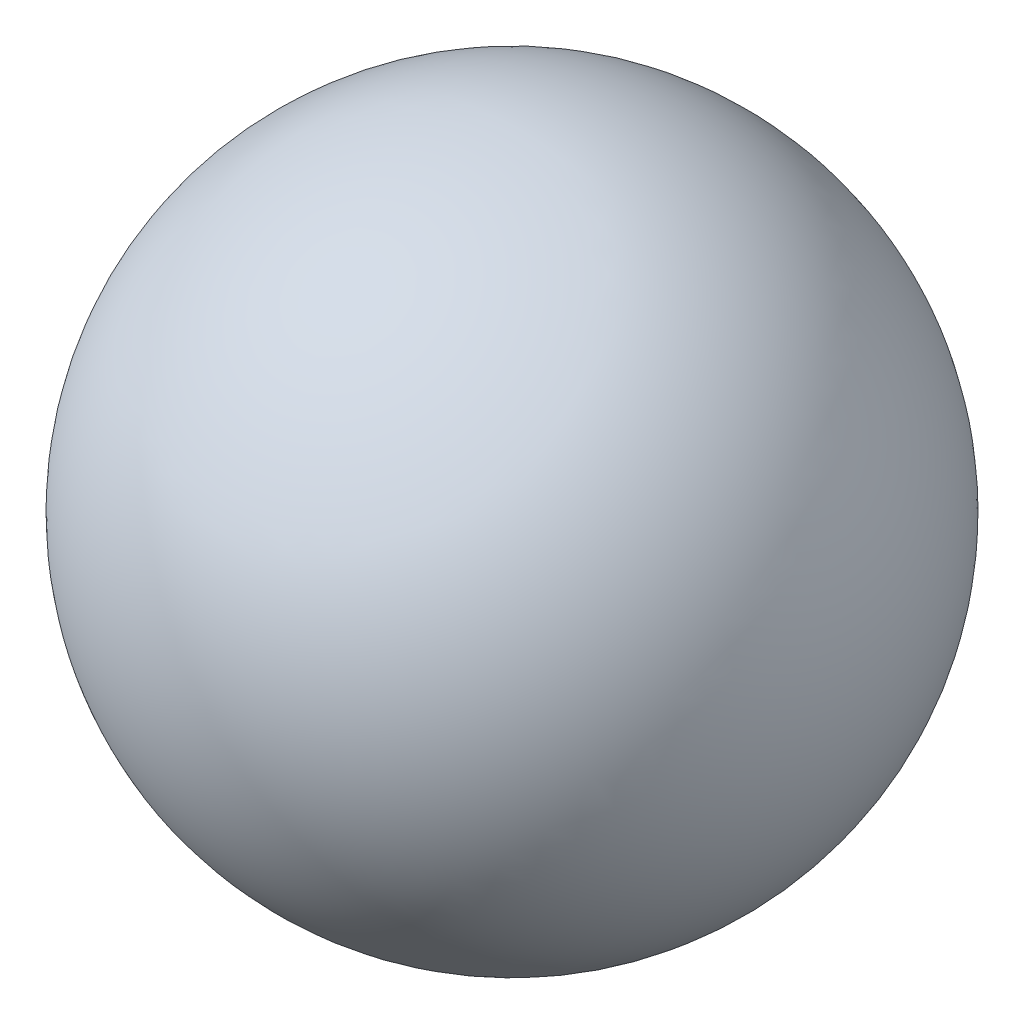
ISO-10303-21;
HEADER;
FILE_DESCRIPTION(('STEP AP214'),'2;1');
FILE_NAME('part.step','',(''),(''),'','','');
FILE_SCHEMA(('AUTOMOTIVE_DESIGN { 1 0 10303 214 1 1 1 1 }'));
ENDSEC;
DATA;
#1=APPLICATION_CONTEXT('core data for automotive mechanical design processes');
#2=APPLICATION_PROTOCOL_DEFINITION('international standard','automotive_design',2000,#1);
#3=PRODUCT_CONTEXT('',#1,'mechanical');
#4=PRODUCT('Part','Part','',(#3));
#5=PRODUCT_RELATED_PRODUCT_CATEGORY('part','',(#4));
#6=PRODUCT_DEFINITION_FORMATION('','',#4);
#7=PRODUCT_DEFINITION_CONTEXT('part definition',#1,'design');
#8=PRODUCT_DEFINITION('design','',#6,#7);
#9=PRODUCT_DEFINITION_SHAPE('','',#8);
#10=(LENGTH_UNIT() NAMED_UNIT(*) SI_UNIT(.MILLI.,.METRE.));
#11=(NAMED_UNIT(*) PLANE_ANGLE_UNIT() SI_UNIT($,.RADIAN.));
#12=(NAMED_UNIT(*) SI_UNIT($,.STERADIAN.) SOLID_ANGLE_UNIT());
#13=UNCERTAINTY_MEASURE_WITH_UNIT(LENGTH_MEASURE(1.E-05),#10,'distance_accuracy_value','');
#14=(GEOMETRIC_REPRESENTATION_CONTEXT(3) GLOBAL_UNCERTAINTY_ASSIGNED_CONTEXT((#13)) GLOBAL_UNIT_ASSIGNED_CONTEXT((#10,
#11,#12)) REPRESENTATION_CONTEXT('',''));
#15=CARTESIAN_POINT('',(0.,0.,0.));
#16=DIRECTION('',(0.,0.,1.));
#17=DIRECTION('',(1.,0.,0.));
#18=AXIS2_PLACEMENT_3D('',#15,#16,#17);
#19=CARTESIAN_POINT('',(0.,4.,0.));
#20=DIRECTION('',(0.,-1.,0.));
#21=DIRECTION('',(-1.,0.,0.));
#22=AXIS2_PLACEMENT_3D('',#19,#20,#21);
#23=SPHERICAL_SURFACE('',#22,4.);
#24=CARTESIAN_POINT('',(0.,4.,0.));
#25=DIRECTION('',(0.,0.,1.));
#26=DIRECTION('',(1.,0.,0.));
#27=AXIS2_PLACEMENT_3D('',#24,#25,#26);
#28=SPHERICAL_SURFACE('',#27,4.);
#29=CARTESIAN_POINT('',(0.,4.,-3.78084302641229));
#30=DIRECTION('',(0.,0.,0.999999999999997));
#31=DIRECTION('',(1.,0.,0.));
#32=AXIS2_PLACEMENT_3D('',#29,#30,#31);
#33=CIRCLE('',#32,1.30584302641229);
#34=CARTESIAN_POINT('',(1.30584302641234,4.,-3.78084302641229));
#35=VERTEX_POINT('',#34);
#36=EDGE_CURVE('E11',#35,#35,#33,.F.);
#37=ORIENTED_EDGE('',*,*,#36,.F.);
#38=EDGE_LOOP('',(#37));
#39=FACE_BOUND('',#38,.T.);
#40=ADVANCED_FACE('F40',(#39),#28,.T.);
#41=CARTESIAN_POINT('',(0.,4.,1.));
#42=DIRECTION('',(0.,0.,-0.999999999999997));
#43=DIRECTION('',(-1.,0.,0.));
#44=AXIS2_PLACEMENT_3D('',#41,#42,#43);
#45=CONICAL_SURFACE('',#44,1.25,1.02974425867665);
#46=CARTESIAN_POINT('',(0.,4.,1.75107577378444));
#47=VERTEX_POINT('',#46);
#48=VERTEX_LOOP('',#47);
#49=FACE_BOUND('',#48,.T.);
#50=CARTESIAN_POINT('',(0.,4.,1.));
#51=DIRECTION('',(0.,0.,-0.999999999999997));
#52=DIRECTION('',(-1.,0.,0.));
#53=AXIS2_PLACEMENT_3D('',#50,#51,#52);
#54=CIRCLE('',#53,1.25);
#55=CARTESIAN_POINT('',(-1.24999999999994,4.,1.));
#56=VERTEX_POINT('',#55);
#57=EDGE_CURVE('E46',#56,#56,#54,.T.);
#58=ORIENTED_EDGE('',*,*,#57,.T.);
#59=EDGE_LOOP('',(#58));
#60=FACE_BOUND('',#59,.T.);
#61=ADVANCED_FACE('F49',(#49,#60),#45,.F.);
#62=CARTESIAN_POINT('',(0.,4.,-4.));
#63=DIRECTION('',(0.,0.,-0.999999999999997));
#64=DIRECTION('',(-1.,0.,0.));
#65=AXIS2_PLACEMENT_3D('',#62,#63,#64);
#66=CYLINDRICAL_SURFACE('',#65,1.25);
#67=ORIENTED_EDGE('',*,*,#57,.F.);
#68=EDGE_LOOP('',(#67));
#69=FACE_BOUND('',#68,.T.);
#70=CARTESIAN_POINT('',(0.,4.,-3.72500000000001));
#71=DIRECTION('',(0.,0.,-0.999999999999997));
#72=DIRECTION('',(-1.,0.,0.));
#73=AXIS2_PLACEMENT_3D('',#70,#71,#72);
#74=CIRCLE('',#73,1.25);
#75=CARTESIAN_POINT('',(-1.24999999999994,4.,-3.72500000000001));
#76=VERTEX_POINT('',#75);
#77=EDGE_CURVE('E56',#76,#76,#74,.T.);
#78=ORIENTED_EDGE('',*,*,#77,.T.);
#79=EDGE_LOOP('',(#78));
#80=FACE_BOUND('',#79,.T.);
#81=ADVANCED_FACE('F52',(#69,#80),#66,.F.);
#82=CARTESIAN_POINT('',(0.,4.,-4.));
#83=DIRECTION('',(0.,0.,-0.999999999999997));
#84=DIRECTION('',(-1.,0.,0.));
#85=AXIS2_PLACEMENT_3D('',#82,#83,#84);
#86=CONICAL_SURFACE('',#85,1.525,0.785398163397448);
#87=ORIENTED_EDGE('',*,*,#36,.T.);
#88=EDGE_LOOP('',(#87));
#89=FACE_BOUND('',#88,.T.);
#90=ORIENTED_EDGE('',*,*,#77,.F.);
#91=EDGE_LOOP('',(#90));
#92=FACE_BOUND('',#91,.T.);
#93=ADVANCED_FACE('F62',(#89,#92),#86,.F.);
#94=CLOSED_SHELL('',(#40,#61,#81,#93));
#95=MANIFOLD_SOLID_BREP('B2',#94);
#96=ADVANCED_BREP_SHAPE_REPRESENTATION('',(#18,#95),#14);
#97=SHAPE_DEFINITION_REPRESENTATION(#9,#96);
ENDSEC;
END-ISO-10303-21;
